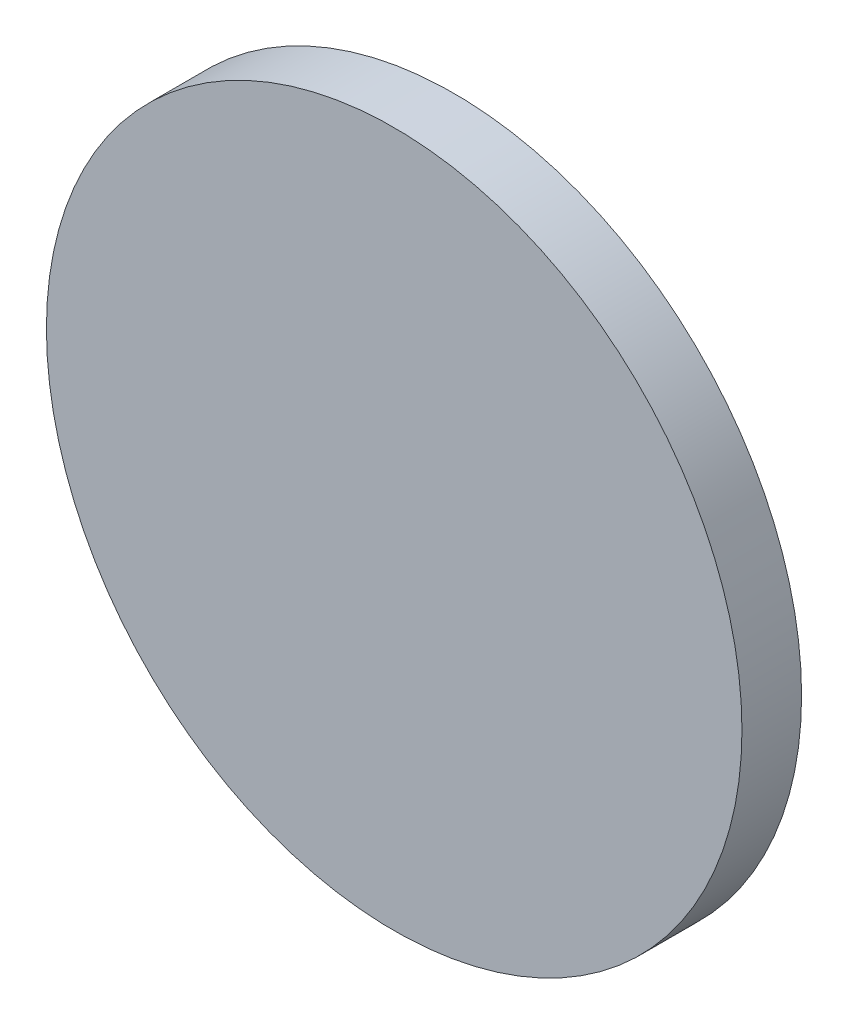
ISO-10303-21;
HEADER;
FILE_DESCRIPTION(('STEP AP214'),'2;1');
FILE_NAME('part.step','',(''),(''),'','','');
FILE_SCHEMA(('AUTOMOTIVE_DESIGN { 1 0 10303 214 1 1 1 1 }'));
ENDSEC;
DATA;
#1=APPLICATION_CONTEXT('core data for automotive mechanical design processes');
#2=APPLICATION_PROTOCOL_DEFINITION('international standard','automotive_design',2000,#1);
#3=PRODUCT_CONTEXT('',#1,'mechanical');
#4=PRODUCT('Part','Part','',(#3));
#5=PRODUCT_RELATED_PRODUCT_CATEGORY('part','',(#4));
#6=PRODUCT_DEFINITION_FORMATION('','',#4);
#7=PRODUCT_DEFINITION_CONTEXT('part definition',#1,'design');
#8=PRODUCT_DEFINITION('design','',#6,#7);
#9=PRODUCT_DEFINITION_SHAPE('','',#8);
#10=(LENGTH_UNIT() NAMED_UNIT(*) SI_UNIT(.MILLI.,.METRE.));
#11=(NAMED_UNIT(*) PLANE_ANGLE_UNIT() SI_UNIT($,.RADIAN.));
#12=(NAMED_UNIT(*) SI_UNIT($,.STERADIAN.) SOLID_ANGLE_UNIT());
#13=UNCERTAINTY_MEASURE_WITH_UNIT(LENGTH_MEASURE(1.E-05),#10,'distance_accuracy_value','');
#14=(GEOMETRIC_REPRESENTATION_CONTEXT(3) GLOBAL_UNCERTAINTY_ASSIGNED_CONTEXT((#13)) GLOBAL_UNIT_ASSIGNED_CONTEXT((#10,
#11,#12)) REPRESENTATION_CONTEXT('',''));
#15=CARTESIAN_POINT('',(0.,0.,0.));
#16=DIRECTION('',(0.,0.,1.));
#17=DIRECTION('',(1.,0.,0.));
#18=AXIS2_PLACEMENT_3D('',#15,#16,#17);
#19=CARTESIAN_POINT('',(9.01,9.806000014875,0.79916));
#20=DIRECTION('',(0.,0.,1.));
#21=DIRECTION('',(1.,0.,0.));
#22=AXIS2_PLACEMENT_3D('',#19,#20,#21);
#23=PLANE('',#22);
#24=CARTESIAN_POINT('',(9.01,9.806000014875,0.79916));
#25=DIRECTION('',(0.,0.,1.));
#26=DIRECTION('',(1.,0.,0.));
#27=AXIS2_PLACEMENT_3D('',#24,#25,#26);
#28=CIRCLE('',#27,0.200024667);
#29=CARTESIAN_POINT('',(9.210024667,9.806000014875,0.79916));
#30=VERTEX_POINT('',#29);
#31=EDGE_CURVE('E18',#30,#30,#28,.F.);
#32=ORIENTED_EDGE('',*,*,#31,.F.);
#33=EDGE_LOOP('',(#32));
#34=FACE_BOUND('',#33,.T.);
#35=ADVANCED_FACE('F15',(#34),#23,.T.);
#36=CARTESIAN_POINT('',(9.01,9.806000014875,0.76487));
#37=DIRECTION('',(0.,0.,1.));
#38=DIRECTION('',(1.,0.,0.));
#39=AXIS2_PLACEMENT_3D('',#36,#37,#38);
#40=CYLINDRICAL_SURFACE('',#39,0.200024667);
#41=ORIENTED_EDGE('',*,*,#31,.T.);
#42=EDGE_LOOP('',(#41));
#43=FACE_BOUND('',#42,.T.);
#44=CARTESIAN_POINT('',(9.01,9.806000014875,0.76487));
#45=DIRECTION('',(0.,0.,1.));
#46=DIRECTION('',(1.,0.,0.));
#47=AXIS2_PLACEMENT_3D('',#44,#45,#46);
#48=CIRCLE('',#47,0.200024667);
#49=CARTESIAN_POINT('',(9.210024667,9.806000014875,0.76487));
#50=VERTEX_POINT('',#49);
#51=EDGE_CURVE('E10',#50,#50,#48,.F.);
#52=ORIENTED_EDGE('',*,*,#51,.F.);
#53=EDGE_LOOP('',(#52));
#54=FACE_BOUND('',#53,.T.);
#55=ADVANCED_FACE('F27',(#43,#54),#40,.T.);
#56=CARTESIAN_POINT('',(9.01,9.806000014875,0.76487));
#57=DIRECTION('',(0.,0.,-1.));
#58=DIRECTION('',(-1.,0.,0.));
#59=AXIS2_PLACEMENT_3D('',#56,#57,#58);
#60=PLANE('',#59);
#61=ORIENTED_EDGE('',*,*,#51,.T.);
#62=EDGE_LOOP('',(#61));
#63=FACE_BOUND('',#62,.T.);
#64=ADVANCED_FACE('F35',(#63),#60,.T.);
#65=CLOSED_SHELL('',(#35,#55,#64));
#66=MANIFOLD_SOLID_BREP('B1',#65);
#67=ADVANCED_BREP_SHAPE_REPRESENTATION('',(#18,#66),#14);
#68=SHAPE_DEFINITION_REPRESENTATION(#9,#67);
ENDSEC;
END-ISO-10303-21;
